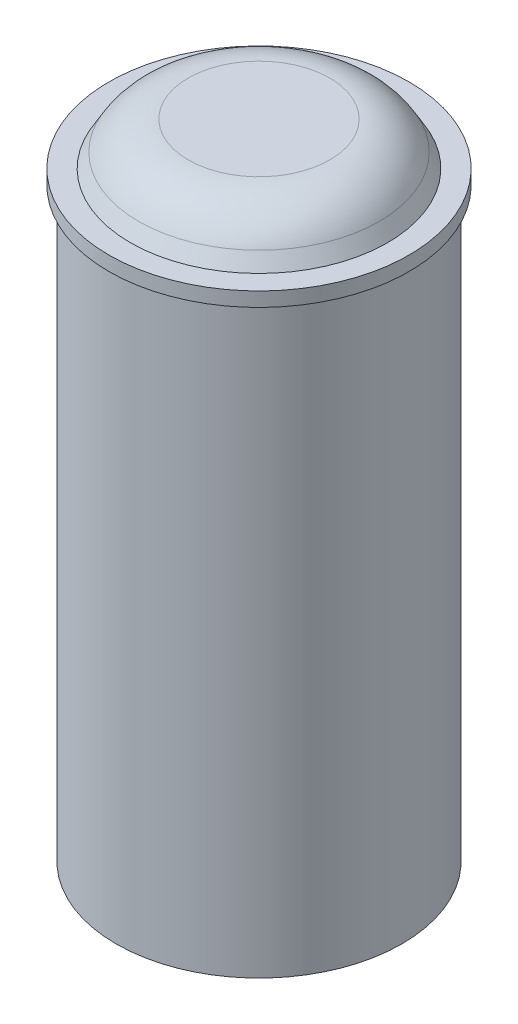
ISO-10303-21;
HEADER;
FILE_DESCRIPTION(('STEP AP214'),'2;1');
FILE_NAME('part.step','',(''),(''),'','','');
FILE_SCHEMA(('AUTOMOTIVE_DESIGN { 1 0 10303 214 1 1 1 1 }'));
ENDSEC;
DATA;
#1=APPLICATION_CONTEXT('core data for automotive mechanical design processes');
#2=APPLICATION_PROTOCOL_DEFINITION('international standard','automotive_design',2000,#1);
#3=PRODUCT_CONTEXT('',#1,'mechanical');
#4=PRODUCT('Part','Part','',(#3));
#5=PRODUCT_RELATED_PRODUCT_CATEGORY('part','',(#4));
#6=PRODUCT_DEFINITION_FORMATION('','',#4);
#7=PRODUCT_DEFINITION_CONTEXT('part definition',#1,'design');
#8=PRODUCT_DEFINITION('design','',#6,#7);
#9=PRODUCT_DEFINITION_SHAPE('','',#8);
#10=(LENGTH_UNIT() NAMED_UNIT(*) SI_UNIT(.MILLI.,.METRE.));
#11=(NAMED_UNIT(*) PLANE_ANGLE_UNIT() SI_UNIT($,.RADIAN.));
#12=(NAMED_UNIT(*) SI_UNIT($,.STERADIAN.) SOLID_ANGLE_UNIT());
#13=UNCERTAINTY_MEASURE_WITH_UNIT(LENGTH_MEASURE(1.E-05),#10,'distance_accuracy_value','');
#14=(GEOMETRIC_REPRESENTATION_CONTEXT(3) GLOBAL_UNCERTAINTY_ASSIGNED_CONTEXT((#13)) GLOBAL_UNIT_ASSIGNED_CONTEXT((#10,
#11,#12)) REPRESENTATION_CONTEXT('',''));
#15=CARTESIAN_POINT('',(0.,0.,0.));
#16=DIRECTION('',(0.,0.,1.));
#17=DIRECTION('',(1.,0.,0.));
#18=AXIS2_PLACEMENT_3D('',#15,#16,#17);
#19=CARTESIAN_POINT('',(0.,53.34,0.));
#20=DIRECTION('',(0.,1.,0.));
#21=DIRECTION('',(0.,0.,1.));
#22=AXIS2_PLACEMENT_3D('',#19,#20,#21);
#23=PLANE('',#22);
#24=CARTESIAN_POINT('',(0.,53.34,0.));
#25=DIRECTION('',(0.,1.,0.));
#26=DIRECTION('',(0.,0.,1.));
#27=AXIS2_PLACEMENT_3D('',#24,#25,#26);
#28=CIRCLE('',#27,13.335);
#29=CARTESIAN_POINT('',(0.,53.34,13.335));
#30=VERTEX_POINT('',#29);
#31=EDGE_CURVE('E171',#30,#30,#28,.T.);
#32=ORIENTED_EDGE('',*,*,#31,.T.);
#33=EDGE_LOOP('',(#32));
#34=FACE_BOUND('',#33,.T.);
#35=CARTESIAN_POINT('',(0.,53.34,0.));
#36=DIRECTION('',(0.,1.,0.));
#37=DIRECTION('',(0.,0.,1.));
#38=AXIS2_PLACEMENT_3D('',#35,#36,#37);
#39=CIRCLE('',#38,11.43);
#40=CARTESIAN_POINT('',(0.,53.34,11.43));
#41=VERTEX_POINT('',#40);
#42=EDGE_CURVE('E175',#41,#41,#39,.T.);
#43=ORIENTED_EDGE('',*,*,#42,.F.);
#44=EDGE_LOOP('',(#43));
#45=FACE_BOUND('',#44,.T.);
#46=ADVANCED_FACE('F90',(#34,#45),#23,.T.);
#47=CARTESIAN_POINT('',(0.,1.27,0.));
#48=DIRECTION('',(0.,-1.,0.));
#49=DIRECTION('',(0.,0.,-1.));
#50=AXIS2_PLACEMENT_3D('',#47,#48,#49);
#51=CYLINDRICAL_SURFACE('',#50,12.7);
#52=CARTESIAN_POINT('',(0.,0.,0.));
#53=DIRECTION('',(0.,1.,0.));
#54=DIRECTION('',(0.,0.,1.));
#55=AXIS2_PLACEMENT_3D('',#52,#53,#54);
#56=CIRCLE('',#55,12.7);
#57=CARTESIAN_POINT('',(0.,0.,12.7));
#58=VERTEX_POINT('',#57);
#59=EDGE_CURVE('E106',#58,#58,#56,.T.);
#60=ORIENTED_EDGE('',*,*,#59,.T.);
#61=EDGE_LOOP('',(#60));
#62=FACE_BOUND('',#61,.T.);
#63=CARTESIAN_POINT('',(0.,52.07,0.));
#64=DIRECTION('',(0.,1.,0.));
#65=DIRECTION('',(0.,0.,1.));
#66=AXIS2_PLACEMENT_3D('',#63,#64,#65);
#67=CIRCLE('',#66,12.7);
#68=CARTESIAN_POINT('',(0.,52.07,12.7));
#69=VERTEX_POINT('',#68);
#70=EDGE_CURVE('E111',#69,#69,#67,.T.);
#71=ORIENTED_EDGE('',*,*,#70,.F.);
#72=EDGE_LOOP('',(#71));
#73=FACE_BOUND('',#72,.T.);
#74=ADVANCED_FACE('F184',(#62,#73),#51,.T.);
#75=CARTESIAN_POINT('',(0.,0.,0.));
#76=DIRECTION('',(0.,1.,0.));
#77=DIRECTION('',(0.,0.,1.));
#78=AXIS2_PLACEMENT_3D('',#75,#76,#77);
#79=PLANE('',#78);
#80=ORIENTED_EDGE('',*,*,#59,.F.);
#81=EDGE_LOOP('',(#80));
#82=FACE_BOUND('',#81,.T.);
#83=ADVANCED_FACE('F190',(#82),#79,.F.);
#84=CARTESIAN_POINT('',(0.,52.07,0.));
#85=DIRECTION('',(0.,1.,0.));
#86=DIRECTION('',(0.,0.,1.));
#87=AXIS2_PLACEMENT_3D('',#84,#85,#86);
#88=PLANE('',#87);
#89=CARTESIAN_POINT('',(0.,52.07,0.));
#90=DIRECTION('',(0.,1.,0.));
#91=DIRECTION('',(0.,0.,1.));
#92=AXIS2_PLACEMENT_3D('',#89,#90,#91);
#93=CIRCLE('',#92,13.335);
#94=CARTESIAN_POINT('',(0.,52.07,13.335));
#95=VERTEX_POINT('',#94);
#96=EDGE_CURVE('E172',#95,#95,#93,.T.);
#97=ORIENTED_EDGE('',*,*,#96,.F.);
#98=EDGE_LOOP('',(#97));
#99=FACE_BOUND('',#98,.T.);
#100=ORIENTED_EDGE('',*,*,#70,.T.);
#101=EDGE_LOOP('',(#100));
#102=FACE_BOUND('',#101,.T.);
#103=ADVANCED_FACE('F195',(#99,#102),#88,.F.);
#104=CARTESIAN_POINT('',(0.,53.34,0.));
#105=DIRECTION('',(0.,-1.,0.));
#106=DIRECTION('',(0.,0.,-1.));
#107=AXIS2_PLACEMENT_3D('',#104,#105,#106);
#108=CYLINDRICAL_SURFACE('',#107,13.335);
#109=ORIENTED_EDGE('',*,*,#31,.F.);
#110=EDGE_LOOP('',(#109));
#111=FACE_BOUND('',#110,.T.);
#112=ORIENTED_EDGE('',*,*,#96,.T.);
#113=EDGE_LOOP('',(#112));
#114=FACE_BOUND('',#113,.T.);
#115=ADVANCED_FACE('F198',(#111,#114),#108,.T.);
#116=CARTESIAN_POINT('',(0.,53.34,0.));
#117=DIRECTION('',(0.,-1.,0.));
#118=DIRECTION('',(0.,0.,1.));
#119=AXIS2_PLACEMENT_3D('',#116,#117,#118);
#120=CONICAL_SURFACE('',#119,11.43,0.5235987755983);
#121=CARTESIAN_POINT('',(0.,54.61,0.));
#122=DIRECTION('',(0.,-1.,0.));
#123=DIRECTION('',(0.,0.,-1.));
#124=AXIS2_PLACEMENT_3D('',#121,#122,#123);
#125=CIRCLE('',#124,10.6967651581292);
#126=CARTESIAN_POINT('',(0.,54.61,-10.6967651581292));
#127=VERTEX_POINT('',#126);
#128=EDGE_CURVE('E11',#127,#127,#125,.T.);
#129=ORIENTED_EDGE('',*,*,#128,.T.);
#130=EDGE_LOOP('',(#129));
#131=FACE_BOUND('',#130,.T.);
#132=ORIENTED_EDGE('',*,*,#42,.T.);
#133=EDGE_LOOP('',(#132));
#134=FACE_BOUND('',#133,.T.);
#135=ADVANCED_FACE('F181',(#131,#134),#120,.T.);
#136=CARTESIAN_POINT('',(0.,57.15,0.));
#137=DIRECTION('',(0.,1.,0.));
#138=DIRECTION('',(0.,0.,1.));
#139=AXIS2_PLACEMENT_3D('',#136,#137,#138);
#140=PLANE('',#139);
#141=CARTESIAN_POINT('',(0.,57.15,0.));
#142=DIRECTION('',(0.,1.,0.));
#143=DIRECTION('',(0.,0.,1.));
#144=AXIS2_PLACEMENT_3D('',#141,#142,#143);
#145=CIRCLE('',#144,6.29735610690422);
#146=CARTESIAN_POINT('',(0.,57.15,6.29735610690422));
#147=VERTEX_POINT('',#146);
#148=EDGE_CURVE('E98',#147,#147,#145,.T.);
#149=ORIENTED_EDGE('',*,*,#148,.T.);
#150=EDGE_LOOP('',(#149));
#151=FACE_BOUND('',#150,.T.);
#152=ADVANCED_FACE('F276',(#151),#140,.T.);
#153=CARTESIAN_POINT('',(0.,52.07,0.));
#154=DIRECTION('',(0.,1.,0.));
#155=DIRECTION('',(0.,0.,1.));
#156=AXIS2_PLACEMENT_3D('',#153,#154,#155);
#157=TOROIDAL_SURFACE('',#156,6.29735610690422,5.08);
#158=ORIENTED_EDGE('',*,*,#128,.F.);
#159=EDGE_LOOP('',(#158));
#160=FACE_BOUND('',#159,.T.);
#161=ORIENTED_EDGE('',*,*,#148,.F.);
#162=EDGE_LOOP('',(#161));
#163=FACE_BOUND('',#162,.T.);
#164=ADVANCED_FACE('F92',(#160,#163),#157,.T.);
#165=CLOSED_SHELL('',(#46,#74,#83,#103,#115,#135,#152,#164));
#166=CARTESIAN_POINT('',(0.,52.07,0.));
#167=DIRECTION('',(0.,1.,0.));
#168=DIRECTION('',(0.,0.,1.));
#169=AXIS2_PLACEMENT_3D('',#166,#167,#168);
#170=CIRCLE('',#169,11.43);
#171=CARTESIAN_POINT('',(0.,52.07,11.43));
#172=VERTEX_POINT('',#171);
#173=EDGE_CURVE('E166',#172,#172,#170,.T.);
#174=ORIENTED_EDGE('',*,*,#173,.F.);
#175=EDGE_LOOP('',(#174));
#176=FACE_BOUND('',#175,.T.);
#177=CARTESIAN_POINT('',(-4.49012806053452,52.07,-4.49012806053463));
#178=DIRECTION('',(0.,1.,0.));
#179=DIRECTION('',(0.,0.,1.));
#180=AXIS2_PLACEMENT_3D('',#177,#178,#179);
#181=CIRCLE('',#180,1.27);
#182=CARTESIAN_POINT('',(-4.49012806053452,52.07,-3.22012806053463));
#183=VERTEX_POINT('',#182);
#184=EDGE_CURVE('E118',#183,#183,#181,.T.);
#185=ORIENTED_EDGE('',*,*,#184,.T.);
#186=EDGE_LOOP('',(#185));
#187=FACE_BOUND('',#186,.T.);
#188=CARTESIAN_POINT('',(0.,52.07,0.));
#189=DIRECTION('',(0.,1.,0.));
#190=DIRECTION('',(0.,0.,1.));
#191=AXIS2_PLACEMENT_3D('',#188,#189,#190);
#192=CIRCLE('',#191,2.54);
#193=CARTESIAN_POINT('',(0.,52.07,2.54));
#194=VERTEX_POINT('',#193);
#195=EDGE_CURVE('E130',#194,#194,#192,.T.);
#196=ORIENTED_EDGE('',*,*,#195,.T.);
#197=EDGE_LOOP('',(#196));
#198=FACE_BOUND('',#197,.T.);
#199=CARTESIAN_POINT('',(4.49012806053458,52.07,-4.49012806053457));
#200=DIRECTION('',(0.,1.,0.));
#201=DIRECTION('',(0.,0.,1.));
#202=AXIS2_PLACEMENT_3D('',#199,#200,#201);
#203=CIRCLE('',#202,1.27);
#204=CARTESIAN_POINT('',(4.49012806053458,52.07,-3.22012806053457));
#205=VERTEX_POINT('',#204);
#206=EDGE_CURVE('E142',#205,#205,#203,.T.);
#207=ORIENTED_EDGE('',*,*,#206,.T.);
#208=EDGE_LOOP('',(#207));
#209=FACE_BOUND('',#208,.T.);
#210=CARTESIAN_POINT('',(4.49012806053455,52.07,4.4901280605346));
#211=DIRECTION('',(0.,1.,0.));
#212=DIRECTION('',(0.,0.,1.));
#213=AXIS2_PLACEMENT_3D('',#210,#211,#212);
#214=CIRCLE('',#213,1.27);
#215=CARTESIAN_POINT('',(4.49012806053455,52.07,5.7601280605346));
#216=VERTEX_POINT('',#215);
#217=EDGE_CURVE('E154',#216,#216,#214,.T.);
#218=ORIENTED_EDGE('',*,*,#217,.T.);
#219=EDGE_LOOP('',(#218));
#220=FACE_BOUND('',#219,.T.);
#221=CARTESIAN_POINT('',(0.,52.07,6.35));
#222=DIRECTION('',(0.,1.,0.));
#223=DIRECTION('',(0.,0.,1.));
#224=AXIS2_PLACEMENT_3D('',#221,#222,#223);
#225=CIRCLE('',#224,1.27);
#226=CARTESIAN_POINT('',(0.,52.07,7.62));
#227=VERTEX_POINT('',#226);
#228=EDGE_CURVE('E160',#227,#227,#225,.T.);
#229=ORIENTED_EDGE('',*,*,#228,.T.);
#230=EDGE_LOOP('',(#229));
#231=FACE_BOUND('',#230,.T.);
#232=CARTESIAN_POINT('',(6.35,52.07,0.));
#233=DIRECTION('',(0.,1.,0.));
#234=DIRECTION('',(0.,0.,1.));
#235=AXIS2_PLACEMENT_3D('',#232,#233,#234);
#236=CIRCLE('',#235,1.27);
#237=CARTESIAN_POINT('',(6.35,52.07,1.27000000000002));
#238=VERTEX_POINT('',#237);
#239=EDGE_CURVE('E148',#238,#238,#236,.T.);
#240=ORIENTED_EDGE('',*,*,#239,.T.);
#241=EDGE_LOOP('',(#240));
#242=FACE_BOUND('',#241,.T.);
#243=CARTESIAN_POINT('',(0.,52.07,-6.35));
#244=DIRECTION('',(0.,1.,0.));
#245=DIRECTION('',(0.,0.,1.));
#246=AXIS2_PLACEMENT_3D('',#243,#244,#245);
#247=CIRCLE('',#246,1.27);
#248=CARTESIAN_POINT('',(0.,52.07,-5.08));
#249=VERTEX_POINT('',#248);
#250=EDGE_CURVE('E136',#249,#249,#247,.T.);
#251=ORIENTED_EDGE('',*,*,#250,.T.);
#252=EDGE_LOOP('',(#251));
#253=FACE_BOUND('',#252,.T.);
#254=CARTESIAN_POINT('',(-4.49012806053462,52.07,4.49012806053454));
#255=DIRECTION('',(0.,1.,0.));
#256=DIRECTION('',(0.,0.,1.));
#257=AXIS2_PLACEMENT_3D('',#254,#255,#256);
#258=CIRCLE('',#257,1.27);
#259=CARTESIAN_POINT('',(-4.49012806053462,52.07,5.76012806053454));
#260=VERTEX_POINT('',#259);
#261=EDGE_CURVE('E124',#260,#260,#258,.T.);
#262=ORIENTED_EDGE('',*,*,#261,.T.);
#263=EDGE_LOOP('',(#262));
#264=FACE_BOUND('',#263,.T.);
#265=CARTESIAN_POINT('',(-6.35,52.07,0.));
#266=DIRECTION('',(0.,1.,0.));
#267=DIRECTION('',(0.,0.,1.));
#268=AXIS2_PLACEMENT_3D('',#265,#266,#267);
#269=CIRCLE('',#268,1.27);
#270=CARTESIAN_POINT('',(-6.35,52.07,1.26999999999993));
#271=VERTEX_POINT('',#270);
#272=EDGE_CURVE('E114',#271,#271,#269,.T.);
#273=ORIENTED_EDGE('',*,*,#272,.T.);
#274=EDGE_LOOP('',(#273));
#275=FACE_BOUND('',#274,.T.);
#276=ADVANCED_FACE('F200',(#176,#187,#198,#209,#220,#231,#242,#253,#264,#275),#88,.F.);
#277=CARTESIAN_POINT('',(6.35,52.07,0.));
#278=DIRECTION('',(0.,-1.,0.));
#279=DIRECTION('',(0.,0.,-1.));
#280=AXIS2_PLACEMENT_3D('',#277,#278,#279);
#281=CYLINDRICAL_SURFACE('',#280,1.27);
#282=ORIENTED_EDGE('',*,*,#239,.F.);
#283=EDGE_LOOP('',(#282));
#284=FACE_BOUND('',#283,.T.);
#285=CARTESIAN_POINT('',(6.35,1.27,0.));
#286=DIRECTION('',(0.,1.,0.));
#287=DIRECTION('',(0.,0.,1.));
#288=AXIS2_PLACEMENT_3D('',#285,#286,#287);
#289=CIRCLE('',#288,1.27);
#290=CARTESIAN_POINT('',(6.35,1.27,1.27000000000002));
#291=VERTEX_POINT('',#290);
#292=EDGE_CURVE('E151',#291,#291,#289,.T.);
#293=ORIENTED_EDGE('',*,*,#292,.T.);
#294=EDGE_LOOP('',(#293));
#295=FACE_BOUND('',#294,.T.);
#296=ADVANCED_FACE('F215',(#284,#295),#281,.T.);
#297=CARTESIAN_POINT('',(0.,52.07,-6.35));
#298=DIRECTION('',(0.,-1.,0.));
#299=DIRECTION('',(0.,0.,-1.));
#300=AXIS2_PLACEMENT_3D('',#297,#298,#299);
#301=CYLINDRICAL_SURFACE('',#300,1.27);
#302=ORIENTED_EDGE('',*,*,#250,.F.);
#303=EDGE_LOOP('',(#302));
#304=FACE_BOUND('',#303,.T.);
#305=CARTESIAN_POINT('',(0.,1.27,-6.35));
#306=DIRECTION('',(0.,1.,0.));
#307=DIRECTION('',(0.,0.,1.));
#308=AXIS2_PLACEMENT_3D('',#305,#306,#307);
#309=CIRCLE('',#308,1.27);
#310=CARTESIAN_POINT('',(0.,1.27,-5.08));
#311=VERTEX_POINT('',#310);
#312=EDGE_CURVE('E139',#311,#311,#309,.T.);
#313=ORIENTED_EDGE('',*,*,#312,.T.);
#314=EDGE_LOOP('',(#313));
#315=FACE_BOUND('',#314,.T.);
#316=ADVANCED_FACE('F218',(#304,#315),#301,.T.);
#317=CARTESIAN_POINT('',(-4.49012806053462,52.07,4.49012806053454));
#318=DIRECTION('',(0.,-1.,0.));
#319=DIRECTION('',(0.,0.,-1.));
#320=AXIS2_PLACEMENT_3D('',#317,#318,#319);
#321=CYLINDRICAL_SURFACE('',#320,1.27);
#322=ORIENTED_EDGE('',*,*,#261,.F.);
#323=EDGE_LOOP('',(#322));
#324=FACE_BOUND('',#323,.T.);
#325=CARTESIAN_POINT('',(-4.49012806053462,1.27,4.49012806053454));
#326=DIRECTION('',(0.,1.,0.));
#327=DIRECTION('',(0.,0.,1.));
#328=AXIS2_PLACEMENT_3D('',#325,#326,#327);
#329=CIRCLE('',#328,1.27);
#330=CARTESIAN_POINT('',(-4.49012806053462,1.27,5.76012806053454));
#331=VERTEX_POINT('',#330);
#332=EDGE_CURVE('E127',#331,#331,#329,.T.);
#333=ORIENTED_EDGE('',*,*,#332,.T.);
#334=EDGE_LOOP('',(#333));
#335=FACE_BOUND('',#334,.T.);
#336=ADVANCED_FACE('F226',(#324,#335),#321,.T.);
#337=CARTESIAN_POINT('',(-6.35,52.07,0.));
#338=DIRECTION('',(0.,-1.,0.));
#339=DIRECTION('',(0.,0.,-1.));
#340=AXIS2_PLACEMENT_3D('',#337,#338,#339);
#341=CYLINDRICAL_SURFACE('',#340,1.27);
#342=ORIENTED_EDGE('',*,*,#272,.F.);
#343=EDGE_LOOP('',(#342));
#344=FACE_BOUND('',#343,.T.);
#345=CARTESIAN_POINT('',(-6.35,1.27,0.));
#346=DIRECTION('',(0.,1.,0.));
#347=DIRECTION('',(0.,0.,1.));
#348=AXIS2_PLACEMENT_3D('',#345,#346,#347);
#349=CIRCLE('',#348,1.27);
#350=CARTESIAN_POINT('',(-6.35,1.27,1.26999999999993));
#351=VERTEX_POINT('',#350);
#352=EDGE_CURVE('E115',#351,#351,#349,.T.);
#353=ORIENTED_EDGE('',*,*,#352,.T.);
#354=EDGE_LOOP('',(#353));
#355=FACE_BOUND('',#354,.T.);
#356=ADVANCED_FACE('F234',(#344,#355),#341,.T.);
#357=CARTESIAN_POINT('',(0.,52.07,0.));
#358=DIRECTION('',(0.,-1.,0.));
#359=DIRECTION('',(0.,0.,-1.));
#360=AXIS2_PLACEMENT_3D('',#357,#358,#359);
#361=CYLINDRICAL_SURFACE('',#360,11.43);
#362=ORIENTED_EDGE('',*,*,#173,.T.);
#363=EDGE_LOOP('',(#362));
#364=FACE_BOUND('',#363,.T.);
#365=CARTESIAN_POINT('',(0.,1.27,0.));
#366=DIRECTION('',(0.,1.,0.));
#367=DIRECTION('',(0.,0.,1.));
#368=AXIS2_PLACEMENT_3D('',#365,#366,#367);
#369=CIRCLE('',#368,11.43);
#370=CARTESIAN_POINT('',(0.,1.27,11.43));
#371=VERTEX_POINT('',#370);
#372=EDGE_CURVE('E102',#371,#371,#369,.F.);
#373=ORIENTED_EDGE('',*,*,#372,.T.);
#374=EDGE_LOOP('',(#373));
#375=FACE_BOUND('',#374,.T.);
#376=ADVANCED_FACE('F238',(#364,#375),#361,.F.);
#377=CARTESIAN_POINT('',(-4.49012806053452,52.07,-4.49012806053463));
#378=DIRECTION('',(0.,-1.,0.));
#379=DIRECTION('',(0.,0.,-1.));
#380=AXIS2_PLACEMENT_3D('',#377,#378,#379);
#381=CYLINDRICAL_SURFACE('',#380,1.27);
#382=ORIENTED_EDGE('',*,*,#184,.F.);
#383=EDGE_LOOP('',(#382));
#384=FACE_BOUND('',#383,.T.);
#385=CARTESIAN_POINT('',(-4.49012806053452,1.27,-4.49012806053463));
#386=DIRECTION('',(0.,1.,0.));
#387=DIRECTION('',(0.,0.,1.));
#388=AXIS2_PLACEMENT_3D('',#385,#386,#387);
#389=CIRCLE('',#388,1.27);
#390=CARTESIAN_POINT('',(-4.49012806053452,1.27,-3.22012806053463));
#391=VERTEX_POINT('',#390);
#392=EDGE_CURVE('E121',#391,#391,#389,.T.);
#393=ORIENTED_EDGE('',*,*,#392,.T.);
#394=EDGE_LOOP('',(#393));
#395=FACE_BOUND('',#394,.T.);
#396=ADVANCED_FACE('F230',(#384,#395),#381,.T.);
#397=CARTESIAN_POINT('',(0.,52.07,0.));
#398=DIRECTION('',(0.,-1.,0.));
#399=DIRECTION('',(0.,0.,-1.));
#400=AXIS2_PLACEMENT_3D('',#397,#398,#399);
#401=CYLINDRICAL_SURFACE('',#400,2.54);
#402=ORIENTED_EDGE('',*,*,#195,.F.);
#403=EDGE_LOOP('',(#402));
#404=FACE_BOUND('',#403,.T.);
#405=CARTESIAN_POINT('',(0.,1.27,0.));
#406=DIRECTION('',(0.,1.,0.));
#407=DIRECTION('',(0.,0.,1.));
#408=AXIS2_PLACEMENT_3D('',#405,#406,#407);
#409=CIRCLE('',#408,2.54);
#410=CARTESIAN_POINT('',(0.,1.27,2.54));
#411=VERTEX_POINT('',#410);
#412=EDGE_CURVE('E133',#411,#411,#409,.T.);
#413=ORIENTED_EDGE('',*,*,#412,.T.);
#414=EDGE_LOOP('',(#413));
#415=FACE_BOUND('',#414,.T.);
#416=ADVANCED_FACE('F222',(#404,#415),#401,.T.);
#417=CARTESIAN_POINT('',(4.49012806053458,52.07,-4.49012806053457));
#418=DIRECTION('',(0.,-1.,0.));
#419=DIRECTION('',(0.,0.,-1.));
#420=AXIS2_PLACEMENT_3D('',#417,#418,#419);
#421=CYLINDRICAL_SURFACE('',#420,1.27);
#422=ORIENTED_EDGE('',*,*,#206,.F.);
#423=EDGE_LOOP('',(#422));
#424=FACE_BOUND('',#423,.T.);
#425=CARTESIAN_POINT('',(4.49012806053458,1.27,-4.49012806053457));
#426=DIRECTION('',(0.,1.,0.));
#427=DIRECTION('',(0.,0.,1.));
#428=AXIS2_PLACEMENT_3D('',#425,#426,#427);
#429=CIRCLE('',#428,1.27);
#430=CARTESIAN_POINT('',(4.49012806053458,1.27,-3.22012806053457));
#431=VERTEX_POINT('',#430);
#432=EDGE_CURVE('E145',#431,#431,#429,.T.);
#433=ORIENTED_EDGE('',*,*,#432,.T.);
#434=EDGE_LOOP('',(#433));
#435=FACE_BOUND('',#434,.T.);
#436=ADVANCED_FACE('F213',(#424,#435),#421,.T.);
#437=CARTESIAN_POINT('',(4.49012806053455,52.07,4.4901280605346));
#438=DIRECTION('',(0.,-1.,0.));
#439=DIRECTION('',(0.,0.,-1.));
#440=AXIS2_PLACEMENT_3D('',#437,#438,#439);
#441=CYLINDRICAL_SURFACE('',#440,1.27);
#442=ORIENTED_EDGE('',*,*,#217,.F.);
#443=EDGE_LOOP('',(#442));
#444=FACE_BOUND('',#443,.T.);
#445=CARTESIAN_POINT('',(4.49012806053455,1.27,4.4901280605346));
#446=DIRECTION('',(0.,1.,0.));
#447=DIRECTION('',(0.,0.,1.));
#448=AXIS2_PLACEMENT_3D('',#445,#446,#447);
#449=CIRCLE('',#448,1.27);
#450=CARTESIAN_POINT('',(4.49012806053455,1.27,5.7601280605346));
#451=VERTEX_POINT('',#450);
#452=EDGE_CURVE('E157',#451,#451,#449,.T.);
#453=ORIENTED_EDGE('',*,*,#452,.T.);
#454=EDGE_LOOP('',(#453));
#455=FACE_BOUND('',#454,.T.);
#456=ADVANCED_FACE('F210',(#444,#455),#441,.T.);
#457=CARTESIAN_POINT('',(0.,1.27,0.));
#458=DIRECTION('',(0.,1.,0.));
#459=DIRECTION('',(0.,0.,1.));
#460=AXIS2_PLACEMENT_3D('',#457,#458,#459);
#461=PLANE('',#460);
#462=ORIENTED_EDGE('',*,*,#452,.F.);
#463=EDGE_LOOP('',(#462));
#464=FACE_BOUND('',#463,.T.);
#465=ORIENTED_EDGE('',*,*,#432,.F.);
#466=EDGE_LOOP('',(#465));
#467=FACE_BOUND('',#466,.T.);
#468=ORIENTED_EDGE('',*,*,#412,.F.);
#469=EDGE_LOOP('',(#468));
#470=FACE_BOUND('',#469,.T.);
#471=ORIENTED_EDGE('',*,*,#392,.F.);
#472=EDGE_LOOP('',(#471));
#473=FACE_BOUND('',#472,.T.);
#474=ORIENTED_EDGE('',*,*,#372,.F.);
#475=EDGE_LOOP('',(#474));
#476=FACE_BOUND('',#475,.T.);
#477=ORIENTED_EDGE('',*,*,#352,.F.);
#478=EDGE_LOOP('',(#477));
#479=FACE_BOUND('',#478,.T.);
#480=ORIENTED_EDGE('',*,*,#332,.F.);
#481=EDGE_LOOP('',(#480));
#482=FACE_BOUND('',#481,.T.);
#483=ORIENTED_EDGE('',*,*,#312,.F.);
#484=EDGE_LOOP('',(#483));
#485=FACE_BOUND('',#484,.T.);
#486=ORIENTED_EDGE('',*,*,#292,.F.);
#487=EDGE_LOOP('',(#486));
#488=FACE_BOUND('',#487,.T.);
#489=CARTESIAN_POINT('',(0.,1.27,6.35));
#490=DIRECTION('',(0.,1.,0.));
#491=DIRECTION('',(0.,0.,1.));
#492=AXIS2_PLACEMENT_3D('',#489,#490,#491);
#493=CIRCLE('',#492,1.27);
#494=CARTESIAN_POINT('',(0.,1.27,7.62));
#495=VERTEX_POINT('',#494);
#496=EDGE_CURVE('E163',#495,#495,#493,.T.);
#497=ORIENTED_EDGE('',*,*,#496,.F.);
#498=EDGE_LOOP('',(#497));
#499=FACE_BOUND('',#498,.T.);
#500=ADVANCED_FACE('F207',(#464,#467,#470,#473,#476,#479,#482,#485,#488,#499),#461,.T.);
#501=CARTESIAN_POINT('',(0.,52.07,6.35));
#502=DIRECTION('',(0.,-1.,0.));
#503=DIRECTION('',(0.,0.,-1.));
#504=AXIS2_PLACEMENT_3D('',#501,#502,#503);
#505=CYLINDRICAL_SURFACE('',#504,1.27);
#506=ORIENTED_EDGE('',*,*,#228,.F.);
#507=EDGE_LOOP('',(#506));
#508=FACE_BOUND('',#507,.T.);
#509=ORIENTED_EDGE('',*,*,#496,.T.);
#510=EDGE_LOOP('',(#509));
#511=FACE_BOUND('',#510,.T.);
#512=ADVANCED_FACE('F204',(#508,#511),#505,.T.);
#513=CLOSED_SHELL('',(#276,#296,#316,#336,#356,#376,#396,#416,#436,#456,#500,#512));
#514=ORIENTED_CLOSED_SHELL('',*,#513,.T.);
#515=BREP_WITH_VOIDS('B2',#165,(#514));
#516=ADVANCED_BREP_SHAPE_REPRESENTATION('',(#18,#515),#14);
#517=SHAPE_DEFINITION_REPRESENTATION(#9,#516);
ENDSEC;
END-ISO-10303-21;
